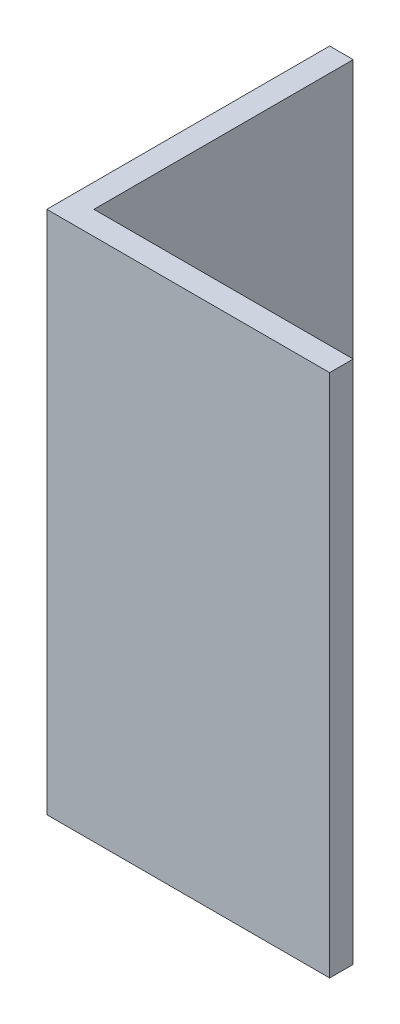
ISO-10303-21;
HEADER;
FILE_DESCRIPTION(('STEP AP214'),'2;1');
FILE_NAME('part.step','',(''),(''),'','','');
FILE_SCHEMA(('AUTOMOTIVE_DESIGN { 1 0 10303 214 1 1 1 1 }'));
ENDSEC;
DATA;
#1=APPLICATION_CONTEXT('core data for automotive mechanical design processes');
#2=APPLICATION_PROTOCOL_DEFINITION('international standard','automotive_design',2000,#1);
#3=PRODUCT_CONTEXT('',#1,'mechanical');
#4=PRODUCT('Part','Part','',(#3));
#5=PRODUCT_RELATED_PRODUCT_CATEGORY('part','',(#4));
#6=PRODUCT_DEFINITION_FORMATION('','',#4);
#7=PRODUCT_DEFINITION_CONTEXT('part definition',#1,'design');
#8=PRODUCT_DEFINITION('design','',#6,#7);
#9=PRODUCT_DEFINITION_SHAPE('','',#8);
#10=(LENGTH_UNIT() NAMED_UNIT(*) SI_UNIT(.MILLI.,.METRE.));
#11=(NAMED_UNIT(*) PLANE_ANGLE_UNIT() SI_UNIT($,.RADIAN.));
#12=(NAMED_UNIT(*) SI_UNIT($,.STERADIAN.) SOLID_ANGLE_UNIT());
#13=UNCERTAINTY_MEASURE_WITH_UNIT(LENGTH_MEASURE(1.E-05),#10,'distance_accuracy_value','');
#14=(GEOMETRIC_REPRESENTATION_CONTEXT(3) GLOBAL_UNCERTAINTY_ASSIGNED_CONTEXT((#13)) GLOBAL_UNIT_ASSIGNED_CONTEXT((#10,
#11,#12)) REPRESENTATION_CONTEXT('',''));
#15=CARTESIAN_POINT('',(0.,0.,0.));
#16=DIRECTION('',(0.,0.,1.));
#17=DIRECTION('',(1.,0.,0.));
#18=AXIS2_PLACEMENT_3D('',#15,#16,#17);
#19=CARTESIAN_POINT('',(-30.9940476190476,70.612,-20.939880952381));
#20=DIRECTION('',(0.,0.,1.));
#21=DIRECTION('',(1.,0.,0.));
#22=AXIS2_PLACEMENT_3D('',#19,#20,#21);
#23=PLANE('',#22);
#24=DIRECTION('',(-1.,0.,0.));
#25=VECTOR('',#24,1.);
#26=CARTESIAN_POINT('',(-30.9940476190476,0.,-20.939880952381));
#27=LINE('',#26,#25);
#28=CARTESIAN_POINT('',(-27.8190476190476,0.,-20.939880952381));
#29=VERTEX_POINT('',#28);
#30=CARTESIAN_POINT('',(-30.9940476190476,0.,-20.939880952381));
#31=VERTEX_POINT('',#30);
#32=EDGE_CURVE('E117',#29,#31,#27,.T.);
#33=ORIENTED_EDGE('',*,*,#32,.T.);
#34=DIRECTION('',(0.,-1.,0.));
#35=VECTOR('',#34,1.);
#36=CARTESIAN_POINT('',(-30.9940476190476,70.612,-20.939880952381));
#37=LINE('',#36,#35);
#38=CARTESIAN_POINT('',(-30.9940476190476,70.612,-20.939880952381));
#39=VERTEX_POINT('',#38);
#40=EDGE_CURVE('E11',#39,#31,#37,.T.);
#41=ORIENTED_EDGE('',*,*,#40,.F.);
#42=DIRECTION('',(-1.,0.,0.));
#43=VECTOR('',#42,1.);
#44=CARTESIAN_POINT('',(-30.9940476190476,70.612,-20.939880952381));
#45=LINE('',#44,#43);
#46=CARTESIAN_POINT('',(-27.8190476190476,70.612,-20.939880952381));
#47=VERTEX_POINT('',#46);
#48=EDGE_CURVE('E127',#47,#39,#45,.T.);
#49=ORIENTED_EDGE('',*,*,#48,.F.);
#50=DIRECTION('',(0.,-1.,0.));
#51=VECTOR('',#50,1.);
#52=CARTESIAN_POINT('',(-27.8190476190476,70.612,-20.939880952381));
#53=LINE('',#52,#51);
#54=EDGE_CURVE('E113',#47,#29,#53,.T.);
#55=ORIENTED_EDGE('',*,*,#54,.T.);
#56=EDGE_LOOP('',(#33,#41,#49,#55));
#57=FACE_BOUND('',#56,.T.);
#58=ADVANCED_FACE('F33',(#57),#23,.F.);
#59=CARTESIAN_POINT('',(-30.9940476190476,70.612,-20.939880952381));
#60=DIRECTION('',(1.,0.,0.));
#61=DIRECTION('',(0.,0.,-1.));
#62=AXIS2_PLACEMENT_3D('',#59,#60,#61);
#63=PLANE('',#62);
#64=DIRECTION('',(0.,0.,1.));
#65=VECTOR('',#64,1.);
#66=CARTESIAN_POINT('',(-30.9940476190476,0.,-20.939880952381));
#67=LINE('',#66,#65);
#68=CARTESIAN_POINT('',(-30.9940476190476,0.,17.160119047619));
#69=VERTEX_POINT('',#68);
#70=EDGE_CURVE('E120',#31,#69,#67,.T.);
#71=ORIENTED_EDGE('',*,*,#70,.T.);
#72=DIRECTION('',(0.,-1.,0.));
#73=VECTOR('',#72,1.);
#74=CARTESIAN_POINT('',(-30.9940476190476,70.612,17.160119047619));
#75=LINE('',#74,#73);
#76=CARTESIAN_POINT('',(-30.9940476190476,70.612,17.160119047619));
#77=VERTEX_POINT('',#76);
#78=EDGE_CURVE('E41',#77,#69,#75,.T.);
#79=ORIENTED_EDGE('',*,*,#78,.F.);
#80=DIRECTION('',(0.,0.,1.));
#81=VECTOR('',#80,1.);
#82=CARTESIAN_POINT('',(-30.9940476190476,70.612,-20.939880952381));
#83=LINE('',#82,#81);
#84=EDGE_CURVE('E86',#39,#77,#83,.T.);
#85=ORIENTED_EDGE('',*,*,#84,.F.);
#86=ORIENTED_EDGE('',*,*,#40,.T.);
#87=EDGE_LOOP('',(#71,#79,#85,#86));
#88=FACE_BOUND('',#87,.T.);
#89=ADVANCED_FACE('F151',(#88),#63,.F.);
#90=CARTESIAN_POINT('',(-30.9940476190476,70.612,17.160119047619));
#91=DIRECTION('',(0.,0.,-1.));
#92=DIRECTION('',(-1.,0.,0.));
#93=AXIS2_PLACEMENT_3D('',#90,#91,#92);
#94=PLANE('',#93);
#95=DIRECTION('',(1.,0.,0.));
#96=VECTOR('',#95,1.);
#97=CARTESIAN_POINT('',(-30.9940476190476,0.,17.160119047619));
#98=LINE('',#97,#96);
#99=CARTESIAN_POINT('',(7.10595238095242,0.,17.160119047619));
#100=VERTEX_POINT('',#99);
#101=EDGE_CURVE('E122',#69,#100,#98,.T.);
#102=ORIENTED_EDGE('',*,*,#101,.T.);
#103=DIRECTION('',(0.,-1.,0.));
#104=VECTOR('',#103,1.);
#105=CARTESIAN_POINT('',(7.10595238095242,70.612,17.160119047619));
#106=LINE('',#105,#104);
#107=CARTESIAN_POINT('',(7.10595238095242,70.612,17.160119047619));
#108=VERTEX_POINT('',#107);
#109=EDGE_CURVE('E108',#108,#100,#106,.T.);
#110=ORIENTED_EDGE('',*,*,#109,.F.);
#111=DIRECTION('',(1.,0.,0.));
#112=VECTOR('',#111,1.);
#113=CARTESIAN_POINT('',(-30.9940476190476,70.612,17.160119047619));
#114=LINE('',#113,#112);
#115=EDGE_CURVE('E99',#77,#108,#114,.T.);
#116=ORIENTED_EDGE('',*,*,#115,.F.);
#117=ORIENTED_EDGE('',*,*,#78,.T.);
#118=EDGE_LOOP('',(#102,#110,#116,#117));
#119=FACE_BOUND('',#118,.T.);
#120=ADVANCED_FACE('F133',(#119),#94,.F.);
#121=CARTESIAN_POINT('',(7.10595238095242,70.612,17.160119047619));
#122=DIRECTION('',(-1.,0.,0.));
#123=DIRECTION('',(0.,0.,1.));
#124=AXIS2_PLACEMENT_3D('',#121,#122,#123);
#125=PLANE('',#124);
#126=DIRECTION('',(0.,0.,-1.));
#127=VECTOR('',#126,1.);
#128=CARTESIAN_POINT('',(7.10595238095242,0.,17.160119047619));
#129=LINE('',#128,#127);
#130=CARTESIAN_POINT('',(7.10595238095242,0.,13.985119047619));
#131=VERTEX_POINT('',#130);
#132=EDGE_CURVE('E107',#100,#131,#129,.T.);
#133=ORIENTED_EDGE('',*,*,#132,.T.);
#134=DIRECTION('',(0.,-1.,0.));
#135=VECTOR('',#134,1.);
#136=CARTESIAN_POINT('',(7.10595238095242,70.612,13.985119047619));
#137=LINE('',#136,#135);
#138=CARTESIAN_POINT('',(7.10595238095242,70.612,13.985119047619));
#139=VERTEX_POINT('',#138);
#140=EDGE_CURVE('E104',#139,#131,#137,.T.);
#141=ORIENTED_EDGE('',*,*,#140,.F.);
#142=DIRECTION('',(0.,0.,-1.));
#143=VECTOR('',#142,1.);
#144=CARTESIAN_POINT('',(7.10595238095242,70.612,17.160119047619));
#145=LINE('',#144,#143);
#146=EDGE_CURVE('E93',#108,#139,#145,.T.);
#147=ORIENTED_EDGE('',*,*,#146,.F.);
#148=ORIENTED_EDGE('',*,*,#109,.T.);
#149=EDGE_LOOP('',(#133,#141,#147,#148));
#150=FACE_BOUND('',#149,.T.);
#151=ADVANCED_FACE('F105',(#150),#125,.F.);
#152=CARTESIAN_POINT('',(7.10595238095242,70.612,13.985119047619));
#153=DIRECTION('',(0.,0.,1.));
#154=DIRECTION('',(1.,0.,0.));
#155=AXIS2_PLACEMENT_3D('',#152,#153,#154);
#156=PLANE('',#155);
#157=DIRECTION('',(-1.,0.,0.));
#158=VECTOR('',#157,1.);
#159=CARTESIAN_POINT('',(7.10595238095242,0.,13.985119047619));
#160=LINE('',#159,#158);
#161=CARTESIAN_POINT('',(-27.8190476190476,0.,13.985119047619));
#162=VERTEX_POINT('',#161);
#163=EDGE_CURVE('E72',#131,#162,#160,.T.);
#164=ORIENTED_EDGE('',*,*,#163,.T.);
#165=DIRECTION('',(0.,-1.,0.));
#166=VECTOR('',#165,1.);
#167=CARTESIAN_POINT('',(-27.8190476190476,70.612,13.985119047619));
#168=LINE('',#167,#166);
#169=CARTESIAN_POINT('',(-27.8190476190476,70.612,13.985119047619));
#170=VERTEX_POINT('',#169);
#171=EDGE_CURVE('E109',#170,#162,#168,.T.);
#172=ORIENTED_EDGE('',*,*,#171,.F.);
#173=DIRECTION('',(-1.,0.,0.));
#174=VECTOR('',#173,1.);
#175=CARTESIAN_POINT('',(7.10595238095242,70.612,13.985119047619));
#176=LINE('',#175,#174);
#177=EDGE_CURVE('E97',#139,#170,#176,.T.);
#178=ORIENTED_EDGE('',*,*,#177,.F.);
#179=ORIENTED_EDGE('',*,*,#140,.T.);
#180=EDGE_LOOP('',(#164,#172,#178,#179));
#181=FACE_BOUND('',#180,.T.);
#182=ADVANCED_FACE('F111',(#181),#156,.F.);
#183=CARTESIAN_POINT('',(-27.8190476190476,70.612,13.985119047619));
#184=DIRECTION('',(-1.,0.,0.));
#185=DIRECTION('',(0.,0.,1.));
#186=AXIS2_PLACEMENT_3D('',#183,#184,#185);
#187=PLANE('',#186);
#188=DIRECTION('',(0.,0.,-1.));
#189=VECTOR('',#188,1.);
#190=CARTESIAN_POINT('',(-27.8190476190476,0.,13.985119047619));
#191=LINE('',#190,#189);
#192=EDGE_CURVE('E78',#162,#29,#191,.T.);
#193=ORIENTED_EDGE('',*,*,#192,.T.);
#194=ORIENTED_EDGE('',*,*,#54,.F.);
#195=DIRECTION('',(0.,0.,-1.));
#196=VECTOR('',#195,1.);
#197=CARTESIAN_POINT('',(-27.8190476190476,70.612,13.985119047619));
#198=LINE('',#197,#196);
#199=EDGE_CURVE('E49',#170,#47,#198,.T.);
#200=ORIENTED_EDGE('',*,*,#199,.F.);
#201=ORIENTED_EDGE('',*,*,#171,.T.);
#202=EDGE_LOOP('',(#193,#194,#200,#201));
#203=FACE_BOUND('',#202,.T.);
#204=ADVANCED_FACE('F140',(#203),#187,.F.);
#205=CARTESIAN_POINT('',(0.,70.612,0.));
#206=DIRECTION('',(0.,1.,0.));
#207=DIRECTION('',(0.,0.,1.));
#208=AXIS2_PLACEMENT_3D('',#205,#206,#207);
#209=PLANE('',#208);
#210=ORIENTED_EDGE('',*,*,#48,.T.);
#211=ORIENTED_EDGE('',*,*,#84,.T.);
#212=ORIENTED_EDGE('',*,*,#115,.T.);
#213=ORIENTED_EDGE('',*,*,#146,.T.);
#214=ORIENTED_EDGE('',*,*,#177,.T.);
#215=ORIENTED_EDGE('',*,*,#199,.T.);
#216=EDGE_LOOP('',(#210,#211,#212,#213,#214,#215));
#217=FACE_BOUND('',#216,.T.);
#218=ADVANCED_FACE('F95',(#217),#209,.T.);
#219=CARTESIAN_POINT('',(0.,0.,0.));
#220=DIRECTION('',(0.,1.,0.));
#221=DIRECTION('',(0.,0.,1.));
#222=AXIS2_PLACEMENT_3D('',#219,#220,#221);
#223=PLANE('',#222);
#224=ORIENTED_EDGE('',*,*,#32,.F.);
#225=ORIENTED_EDGE('',*,*,#192,.F.);
#226=ORIENTED_EDGE('',*,*,#163,.F.);
#227=ORIENTED_EDGE('',*,*,#132,.F.);
#228=ORIENTED_EDGE('',*,*,#101,.F.);
#229=ORIENTED_EDGE('',*,*,#70,.F.);
#230=EDGE_LOOP('',(#224,#225,#226,#227,#228,#229));
#231=FACE_BOUND('',#230,.T.);
#232=ADVANCED_FACE('F136',(#231),#223,.F.);
#233=CLOSED_SHELL('',(#58,#89,#120,#151,#182,#204,#218,#232));
#234=MANIFOLD_SOLID_BREP('B2',#233);
#235=ADVANCED_BREP_SHAPE_REPRESENTATION('',(#18,#234),#14);
#236=SHAPE_DEFINITION_REPRESENTATION(#9,#235);
ENDSEC;
END-ISO-10303-21;
